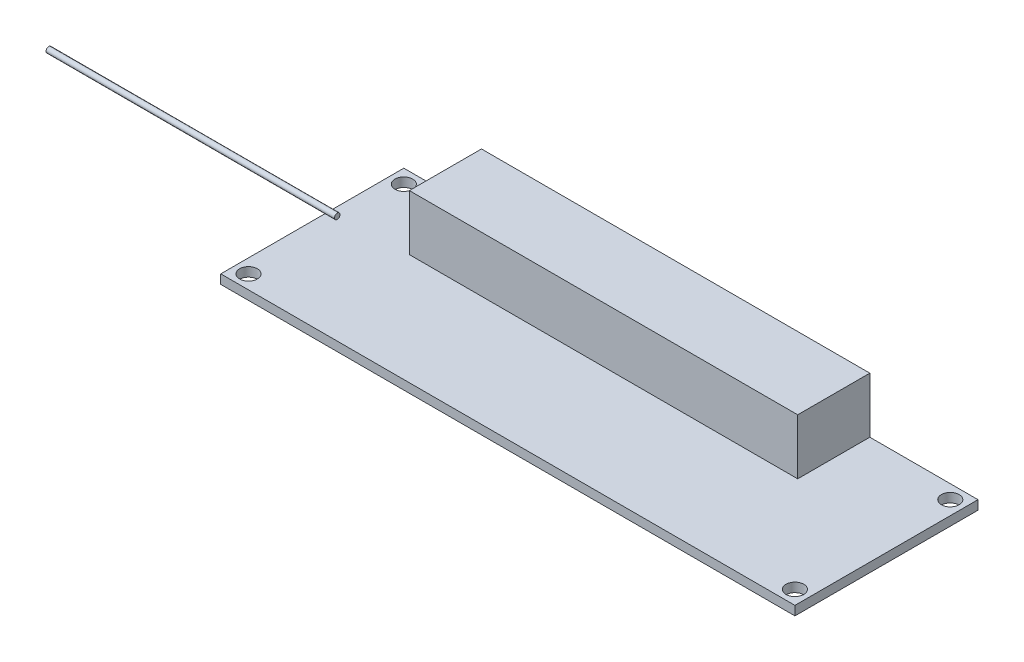
ISO-10303-21;
HEADER;
FILE_DESCRIPTION(('STEP AP214'),'2;1');
FILE_NAME('part.step','',(''),(''),'','','');
FILE_SCHEMA(('AUTOMOTIVE_DESIGN { 1 0 10303 214 1 1 1 1 }'));
ENDSEC;
DATA;
#1=APPLICATION_CONTEXT('core data for automotive mechanical design processes');
#2=APPLICATION_PROTOCOL_DEFINITION('international standard','automotive_design',2000,#1);
#3=PRODUCT_CONTEXT('',#1,'mechanical');
#4=PRODUCT('Part','Part','',(#3));
#5=PRODUCT_RELATED_PRODUCT_CATEGORY('part','',(#4));
#6=PRODUCT_DEFINITION_FORMATION('','',#4);
#7=PRODUCT_DEFINITION_CONTEXT('part definition',#1,'design');
#8=PRODUCT_DEFINITION('design','',#6,#7);
#9=PRODUCT_DEFINITION_SHAPE('','',#8);
#10=(LENGTH_UNIT() NAMED_UNIT(*) SI_UNIT(.MILLI.,.METRE.));
#11=(NAMED_UNIT(*) PLANE_ANGLE_UNIT() SI_UNIT($,.RADIAN.));
#12=(NAMED_UNIT(*) SI_UNIT($,.STERADIAN.) SOLID_ANGLE_UNIT());
#13=UNCERTAINTY_MEASURE_WITH_UNIT(LENGTH_MEASURE(1.E-05),#10,'distance_accuracy_value','');
#14=(GEOMETRIC_REPRESENTATION_CONTEXT(3) GLOBAL_UNCERTAINTY_ASSIGNED_CONTEXT((#13)) GLOBAL_UNIT_ASSIGNED_CONTEXT((#10,
#11,#12)) REPRESENTATION_CONTEXT('',''));
#15=CARTESIAN_POINT('',(0.,0.,0.));
#16=DIRECTION('',(0.,0.,1.));
#17=DIRECTION('',(1.,0.,0.));
#18=AXIS2_PLACEMENT_3D('',#15,#16,#17);
#19=CARTESIAN_POINT('',(-49.75,2.15,-2.5));
#20=DIRECTION('',(-1.,0.,0.));
#21=DIRECTION('',(0.,0.,1.));
#22=AXIS2_PLACEMENT_3D('',#19,#20,#21);
#23=CYLINDRICAL_SURFACE('',#22,0.5);
#24=CARTESIAN_POINT('',(-49.75,2.15,-2.5));
#25=DIRECTION('',(-1.,0.,0.));
#26=DIRECTION('',(0.,0.,1.));
#27=AXIS2_PLACEMENT_3D('',#24,#25,#26);
#28=CIRCLE('',#27,0.5);
#29=CARTESIAN_POINT('',(-49.75,2.15,-2.));
#30=VERTEX_POINT('',#29);
#31=EDGE_CURVE('E11',#30,#30,#28,.T.);
#32=ORIENTED_EDGE('',*,*,#31,.T.);
#33=EDGE_LOOP('',(#32));
#34=FACE_BOUND('',#33,.T.);
#35=CARTESIAN_POINT('',(-101.75,2.15,-2.49999999999999));
#36=DIRECTION('',(-1.,0.,0.));
#37=DIRECTION('',(0.,0.,1.));
#38=AXIS2_PLACEMENT_3D('',#35,#36,#37);
#39=CIRCLE('',#38,0.5);
#40=CARTESIAN_POINT('',(-101.75,2.15,-1.99999999999999));
#41=VERTEX_POINT('',#40);
#42=EDGE_CURVE('E50',#41,#41,#39,.T.);
#43=ORIENTED_EDGE('',*,*,#42,.F.);
#44=EDGE_LOOP('',(#43));
#45=FACE_BOUND('',#44,.T.);
#46=ADVANCED_FACE('F44',(#34,#45),#23,.T.);
#47=CARTESIAN_POINT('',(-49.75,2.15,-2.5));
#48=DIRECTION('',(-1.,0.,0.));
#49=DIRECTION('',(0.,0.,1.));
#50=AXIS2_PLACEMENT_3D('',#47,#48,#49);
#51=PLANE('',#50);
#52=ORIENTED_EDGE('',*,*,#31,.F.);
#53=EDGE_LOOP('',(#52));
#54=FACE_BOUND('',#53,.T.);
#55=ADVANCED_FACE('F59',(#54),#51,.F.);
#56=CARTESIAN_POINT('',(-101.75,2.15,-2.49999999999999));
#57=DIRECTION('',(-1.,0.,0.));
#58=DIRECTION('',(0.,0.,1.));
#59=AXIS2_PLACEMENT_3D('',#56,#57,#58);
#60=PLANE('',#59);
#61=ORIENTED_EDGE('',*,*,#42,.T.);
#62=EDGE_LOOP('',(#61));
#63=FACE_BOUND('',#62,.T.);
#64=ADVANCED_FACE('F56',(#63),#60,.T.);
#65=CLOSED_SHELL('',(#46,#55,#64));
#66=MANIFOLD_SOLID_BREP('B2',#65);
#67=CARTESIAN_POINT('',(-51.75,1.65,-16.5));
#68=DIRECTION('',(1.,0.,0.));
#69=DIRECTION('',(0.,0.,-1.));
#70=AXIS2_PLACEMENT_3D('',#67,#68,#69);
#71=PLANE('',#70);
#72=DIRECTION('',(0.,0.,1.));
#73=VECTOR('',#72,1.);
#74=CARTESIAN_POINT('',(-51.75,0.,-16.5));
#75=LINE('',#74,#73);
#76=CARTESIAN_POINT('',(-51.75,0.,-16.5));
#77=VERTEX_POINT('',#76);
#78=CARTESIAN_POINT('',(-51.75,0.,16.5));
#79=VERTEX_POINT('',#78);
#80=EDGE_CURVE('E168',#77,#79,#75,.T.);
#81=ORIENTED_EDGE('',*,*,#80,.T.);
#82=DIRECTION('',(0.,-1.,0.));
#83=VECTOR('',#82,1.);
#84=CARTESIAN_POINT('',(-51.75,1.65,16.5));
#85=LINE('',#84,#83);
#86=CARTESIAN_POINT('',(-51.75,1.65,16.5));
#87=VERTEX_POINT('',#86);
#88=EDGE_CURVE('E42',#87,#79,#85,.T.);
#89=ORIENTED_EDGE('',*,*,#88,.F.);
#90=DIRECTION('',(0.,0.,1.));
#91=VECTOR('',#90,1.);
#92=CARTESIAN_POINT('',(-51.75,1.65,-16.5));
#93=LINE('',#92,#91);
#94=CARTESIAN_POINT('',(-51.75,1.65,-16.5));
#95=VERTEX_POINT('',#94);
#96=EDGE_CURVE('E177',#95,#87,#93,.T.);
#97=ORIENTED_EDGE('',*,*,#96,.F.);
#98=DIRECTION('',(0.,-1.,0.));
#99=VECTOR('',#98,1.);
#100=CARTESIAN_POINT('',(-51.75,1.65,-16.5));
#101=LINE('',#100,#99);
#102=EDGE_CURVE('E187',#95,#77,#101,.T.);
#103=ORIENTED_EDGE('',*,*,#102,.T.);
#104=EDGE_LOOP('',(#81,#89,#97,#103));
#105=FACE_BOUND('',#104,.T.);
#106=ADVANCED_FACE('F84',(#105),#71,.F.);
#107=CARTESIAN_POINT('',(-51.75,1.65,16.5));
#108=DIRECTION('',(0.,0.,-1.));
#109=DIRECTION('',(-1.,0.,0.));
#110=AXIS2_PLACEMENT_3D('',#107,#108,#109);
#111=PLANE('',#110);
#112=DIRECTION('',(1.,0.,0.));
#113=VECTOR('',#112,1.);
#114=CARTESIAN_POINT('',(-51.75,0.,16.5));
#115=LINE('',#114,#113);
#116=CARTESIAN_POINT('',(51.75,0.,16.5));
#117=VERTEX_POINT('',#116);
#118=EDGE_CURVE('E171',#79,#117,#115,.T.);
#119=ORIENTED_EDGE('',*,*,#118,.T.);
#120=DIRECTION('',(0.,-1.,0.));
#121=VECTOR('',#120,1.);
#122=CARTESIAN_POINT('',(51.75,1.65,16.5));
#123=LINE('',#122,#121);
#124=CARTESIAN_POINT('',(51.75,1.65,16.5));
#125=VERTEX_POINT('',#124);
#126=EDGE_CURVE('E91',#125,#117,#123,.T.);
#127=ORIENTED_EDGE('',*,*,#126,.F.);
#128=DIRECTION('',(1.,0.,0.));
#129=VECTOR('',#128,1.);
#130=CARTESIAN_POINT('',(-51.75,1.65,16.5));
#131=LINE('',#130,#129);
#132=EDGE_CURVE('E180',#87,#125,#131,.T.);
#133=ORIENTED_EDGE('',*,*,#132,.F.);
#134=ORIENTED_EDGE('',*,*,#88,.T.);
#135=EDGE_LOOP('',(#119,#127,#133,#134));
#136=FACE_BOUND('',#135,.T.);
#137=ADVANCED_FACE('F279',(#136),#111,.F.);
#138=CARTESIAN_POINT('',(51.75,1.65,-16.5));
#139=DIRECTION('',(-1.,0.,0.));
#140=DIRECTION('',(0.,0.,1.));
#141=AXIS2_PLACEMENT_3D('',#138,#139,#140);
#142=PLANE('',#141);
#143=DIRECTION('',(0.,0.,-1.));
#144=VECTOR('',#143,1.);
#145=CARTESIAN_POINT('',(51.75,0.,-16.5));
#146=LINE('',#145,#144);
#147=CARTESIAN_POINT('',(51.75,0.,-16.5));
#148=VERTEX_POINT('',#147);
#149=EDGE_CURVE('E190',#117,#148,#146,.T.);
#150=ORIENTED_EDGE('',*,*,#149,.T.);
#151=DIRECTION('',(0.,-1.,0.));
#152=VECTOR('',#151,1.);
#153=CARTESIAN_POINT('',(51.75,1.65,-16.5));
#154=LINE('',#153,#152);
#155=CARTESIAN_POINT('',(51.75,1.65,-16.5));
#156=VERTEX_POINT('',#155);
#157=EDGE_CURVE('E195',#156,#148,#154,.T.);
#158=ORIENTED_EDGE('',*,*,#157,.F.);
#159=DIRECTION('',(0.,0.,-1.));
#160=VECTOR('',#159,1.);
#161=CARTESIAN_POINT('',(51.75,1.65,-16.5));
#162=LINE('',#161,#160);
#163=EDGE_CURVE('E183',#125,#156,#162,.T.);
#164=ORIENTED_EDGE('',*,*,#163,.F.);
#165=ORIENTED_EDGE('',*,*,#126,.T.);
#166=EDGE_LOOP('',(#150,#158,#164,#165));
#167=FACE_BOUND('',#166,.T.);
#168=ADVANCED_FACE('F202',(#167),#142,.F.);
#169=CARTESIAN_POINT('',(-51.75,1.65,-16.5));
#170=DIRECTION('',(0.,0.,1.));
#171=DIRECTION('',(1.,0.,0.));
#172=AXIS2_PLACEMENT_3D('',#169,#170,#171);
#173=PLANE('',#172);
#174=DIRECTION('',(-1.,0.,0.));
#175=VECTOR('',#174,1.);
#176=CARTESIAN_POINT('',(-51.75,0.,-16.5));
#177=LINE('',#176,#175);
#178=EDGE_CURVE('E181',#148,#77,#177,.T.);
#179=ORIENTED_EDGE('',*,*,#178,.T.);
#180=ORIENTED_EDGE('',*,*,#102,.F.);
#181=DIRECTION('',(-1.,0.,0.));
#182=VECTOR('',#181,1.);
#183=CARTESIAN_POINT('',(-51.75,1.65,-16.5));
#184=LINE('',#183,#182);
#185=CARTESIAN_POINT('',(-37.75,1.65,-16.5));
#186=VERTEX_POINT('',#185);
#187=EDGE_CURVE('E185',#186,#95,#184,.T.);
#188=ORIENTED_EDGE('',*,*,#187,.F.);
#189=DIRECTION('',(0.,-1.,0.));
#190=VECTOR('',#189,1.);
#191=CARTESIAN_POINT('',(-37.75,11.65,-16.5));
#192=LINE('',#191,#190);
#193=CARTESIAN_POINT('',(-37.75,11.65,-16.5));
#194=VERTEX_POINT('',#193);
#195=EDGE_CURVE('E217',#194,#186,#192,.T.);
#196=ORIENTED_EDGE('',*,*,#195,.F.);
#197=DIRECTION('',(-1.,0.,0.));
#198=VECTOR('',#197,1.);
#199=CARTESIAN_POINT('',(-37.75,11.65,-16.5));
#200=LINE('',#199,#198);
#201=CARTESIAN_POINT('',(32.25,11.65,-16.5));
#202=VERTEX_POINT('',#201);
#203=EDGE_CURVE('E161',#202,#194,#200,.T.);
#204=ORIENTED_EDGE('',*,*,#203,.F.);
#205=DIRECTION('',(0.,-1.,0.));
#206=VECTOR('',#205,1.);
#207=CARTESIAN_POINT('',(32.25,11.65,-16.5));
#208=LINE('',#207,#206);
#209=CARTESIAN_POINT('',(32.25,1.65,-16.5));
#210=VERTEX_POINT('',#209);
#211=EDGE_CURVE('E173',#202,#210,#208,.T.);
#212=ORIENTED_EDGE('',*,*,#211,.T.);
#213=EDGE_CURVE('E186',#156,#210,#184,.T.);
#214=ORIENTED_EDGE('',*,*,#213,.F.);
#215=ORIENTED_EDGE('',*,*,#157,.T.);
#216=EDGE_LOOP('',(#179,#180,#188,#196,#204,#212,#214,#215));
#217=FACE_BOUND('',#216,.T.);
#218=ADVANCED_FACE('F211',(#217),#173,.F.);
#219=CARTESIAN_POINT('',(0.,1.65,0.));
#220=DIRECTION('',(0.,1.,0.));
#221=DIRECTION('',(0.,0.,1.));
#222=AXIS2_PLACEMENT_3D('',#219,#220,#221);
#223=PLANE('',#222);
#224=CARTESIAN_POINT('',(-49.25,1.65,14.));
#225=DIRECTION('',(0.,1.,0.));
#226=DIRECTION('',(0.,0.,-1.));
#227=AXIS2_PLACEMENT_3D('',#224,#225,#226);
#228=CIRCLE('',#227,1.6);
#229=CARTESIAN_POINT('',(-49.25,1.65,12.4));
#230=VERTEX_POINT('',#229);
#231=EDGE_CURVE('E234',#230,#230,#228,.T.);
#232=ORIENTED_EDGE('',*,*,#231,.F.);
#233=EDGE_LOOP('',(#232));
#234=FACE_BOUND('',#233,.T.);
#235=CARTESIAN_POINT('',(49.25,1.65,14.));
#236=DIRECTION('',(0.,1.,0.));
#237=DIRECTION('',(0.,0.,1.));
#238=AXIS2_PLACEMENT_3D('',#235,#236,#237);
#239=CIRCLE('',#238,1.6);
#240=CARTESIAN_POINT('',(49.25,1.65,15.6));
#241=VERTEX_POINT('',#240);
#242=EDGE_CURVE('E240',#241,#241,#239,.T.);
#243=ORIENTED_EDGE('',*,*,#242,.F.);
#244=EDGE_LOOP('',(#243));
#245=FACE_BOUND('',#244,.T.);
#246=CARTESIAN_POINT('',(49.25,1.65,-14.));
#247=DIRECTION('',(0.,1.,0.));
#248=DIRECTION('',(0.,0.,-1.));
#249=AXIS2_PLACEMENT_3D('',#246,#247,#248);
#250=CIRCLE('',#249,1.6);
#251=CARTESIAN_POINT('',(49.25,1.65,-15.6));
#252=VERTEX_POINT('',#251);
#253=EDGE_CURVE('E246',#252,#252,#250,.T.);
#254=ORIENTED_EDGE('',*,*,#253,.F.);
#255=EDGE_LOOP('',(#254));
#256=FACE_BOUND('',#255,.T.);
#257=CARTESIAN_POINT('',(-49.25,1.65,-14.));
#258=DIRECTION('',(0.,1.,0.));
#259=DIRECTION('',(0.,0.,1.));
#260=AXIS2_PLACEMENT_3D('',#257,#258,#259);
#261=CIRCLE('',#260,1.6);
#262=CARTESIAN_POINT('',(-49.25,1.65,-12.4));
#263=VERTEX_POINT('',#262);
#264=EDGE_CURVE('E228',#263,#263,#261,.T.);
#265=ORIENTED_EDGE('',*,*,#264,.F.);
#266=EDGE_LOOP('',(#265));
#267=FACE_BOUND('',#266,.T.);
#268=DIRECTION('',(0.,0.,1.));
#269=VECTOR('',#268,1.);
#270=CARTESIAN_POINT('',(-37.75,1.65,-16.5));
#271=LINE('',#270,#269);
#272=CARTESIAN_POINT('',(-37.75,1.65,-3.5));
#273=VERTEX_POINT('',#272);
#274=EDGE_CURVE('E103',#186,#273,#271,.T.);
#275=ORIENTED_EDGE('',*,*,#274,.F.);
#276=ORIENTED_EDGE('',*,*,#187,.T.);
#277=ORIENTED_EDGE('',*,*,#96,.T.);
#278=ORIENTED_EDGE('',*,*,#132,.T.);
#279=ORIENTED_EDGE('',*,*,#163,.T.);
#280=ORIENTED_EDGE('',*,*,#213,.T.);
#281=DIRECTION('',(0.,0.,-1.));
#282=VECTOR('',#281,1.);
#283=CARTESIAN_POINT('',(32.25,1.65,-16.5));
#284=LINE('',#283,#282);
#285=CARTESIAN_POINT('',(32.25,1.65,-3.5));
#286=VERTEX_POINT('',#285);
#287=EDGE_CURVE('E165',#286,#210,#284,.T.);
#288=ORIENTED_EDGE('',*,*,#287,.F.);
#289=DIRECTION('',(1.,0.,0.));
#290=VECTOR('',#289,1.);
#291=CARTESIAN_POINT('',(-37.75,1.65,-3.5));
#292=LINE('',#291,#290);
#293=EDGE_CURVE('E98',#273,#286,#292,.T.);
#294=ORIENTED_EDGE('',*,*,#293,.F.);
#295=EDGE_LOOP('',(#275,#276,#277,#278,#279,#280,#288,#294));
#296=FACE_BOUND('',#295,.T.);
#297=ADVANCED_FACE('F216',(#234,#245,#256,#267,#296),#223,.T.);
#298=CARTESIAN_POINT('',(0.,0.,0.));
#299=DIRECTION('',(0.,1.,0.));
#300=DIRECTION('',(0.,0.,1.));
#301=AXIS2_PLACEMENT_3D('',#298,#299,#300);
#302=PLANE('',#301);
#303=CARTESIAN_POINT('',(-49.25,0.,14.));
#304=DIRECTION('',(0.,1.,0.));
#305=DIRECTION('',(0.,0.,-1.));
#306=AXIS2_PLACEMENT_3D('',#303,#304,#305);
#307=CIRCLE('',#306,1.6);
#308=CARTESIAN_POINT('',(-49.25,0.,12.4));
#309=VERTEX_POINT('',#308);
#310=EDGE_CURVE('E237',#309,#309,#307,.T.);
#311=ORIENTED_EDGE('',*,*,#310,.T.);
#312=EDGE_LOOP('',(#311));
#313=FACE_BOUND('',#312,.T.);
#314=CARTESIAN_POINT('',(49.25,0.,14.));
#315=DIRECTION('',(0.,1.,0.));
#316=DIRECTION('',(0.,0.,1.));
#317=AXIS2_PLACEMENT_3D('',#314,#315,#316);
#318=CIRCLE('',#317,1.6);
#319=CARTESIAN_POINT('',(49.25,0.,15.6));
#320=VERTEX_POINT('',#319);
#321=EDGE_CURVE('E243',#320,#320,#318,.T.);
#322=ORIENTED_EDGE('',*,*,#321,.T.);
#323=EDGE_LOOP('',(#322));
#324=FACE_BOUND('',#323,.T.);
#325=CARTESIAN_POINT('',(49.25,0.,-14.));
#326=DIRECTION('',(0.,1.,0.));
#327=DIRECTION('',(0.,0.,-1.));
#328=AXIS2_PLACEMENT_3D('',#325,#326,#327);
#329=CIRCLE('',#328,1.6);
#330=CARTESIAN_POINT('',(49.25,0.,-15.6));
#331=VERTEX_POINT('',#330);
#332=EDGE_CURVE('E231',#331,#331,#329,.T.);
#333=ORIENTED_EDGE('',*,*,#332,.T.);
#334=EDGE_LOOP('',(#333));
#335=FACE_BOUND('',#334,.T.);
#336=CARTESIAN_POINT('',(-49.25,0.,-14.));
#337=DIRECTION('',(0.,1.,0.));
#338=DIRECTION('',(0.,0.,1.));
#339=AXIS2_PLACEMENT_3D('',#336,#337,#338);
#340=CIRCLE('',#339,1.6);
#341=CARTESIAN_POINT('',(-49.25,0.,-12.4));
#342=VERTEX_POINT('',#341);
#343=EDGE_CURVE('E225',#342,#342,#340,.T.);
#344=ORIENTED_EDGE('',*,*,#343,.T.);
#345=EDGE_LOOP('',(#344));
#346=FACE_BOUND('',#345,.T.);
#347=ORIENTED_EDGE('',*,*,#80,.F.);
#348=ORIENTED_EDGE('',*,*,#178,.F.);
#349=ORIENTED_EDGE('',*,*,#149,.F.);
#350=ORIENTED_EDGE('',*,*,#118,.F.);
#351=EDGE_LOOP('',(#347,#348,#349,#350));
#352=FACE_BOUND('',#351,.T.);
#353=ADVANCED_FACE('F208',(#313,#324,#335,#346,#352),#302,.F.);
#354=CARTESIAN_POINT('',(-37.75,11.65,-16.5));
#355=DIRECTION('',(1.,0.,0.));
#356=DIRECTION('',(0.,0.,-1.));
#357=AXIS2_PLACEMENT_3D('',#354,#355,#356);
#358=PLANE('',#357);
#359=ORIENTED_EDGE('',*,*,#274,.T.);
#360=DIRECTION('',(0.,-1.,0.));
#361=VECTOR('',#360,1.);
#362=CARTESIAN_POINT('',(-37.75,11.65,-3.5));
#363=LINE('',#362,#361);
#364=CARTESIAN_POINT('',(-37.75,11.65,-3.5));
#365=VERTEX_POINT('',#364);
#366=EDGE_CURVE('E150',#365,#273,#363,.T.);
#367=ORIENTED_EDGE('',*,*,#366,.F.);
#368=DIRECTION('',(0.,0.,1.));
#369=VECTOR('',#368,1.);
#370=CARTESIAN_POINT('',(-37.75,11.65,-16.5));
#371=LINE('',#370,#369);
#372=EDGE_CURVE('E156',#194,#365,#371,.T.);
#373=ORIENTED_EDGE('',*,*,#372,.F.);
#374=ORIENTED_EDGE('',*,*,#195,.T.);
#375=EDGE_LOOP('',(#359,#367,#373,#374));
#376=FACE_BOUND('',#375,.T.);
#377=ADVANCED_FACE('F167',(#376),#358,.F.);
#378=CARTESIAN_POINT('',(-37.75,11.65,-3.5));
#379=DIRECTION('',(0.,0.,-1.));
#380=DIRECTION('',(-1.,0.,0.));
#381=AXIS2_PLACEMENT_3D('',#378,#379,#380);
#382=PLANE('',#381);
#383=ORIENTED_EDGE('',*,*,#293,.T.);
#384=DIRECTION('',(0.,-1.,0.));
#385=VECTOR('',#384,1.);
#386=CARTESIAN_POINT('',(32.25,11.65,-3.5));
#387=LINE('',#386,#385);
#388=CARTESIAN_POINT('',(32.25,11.65,-3.5));
#389=VERTEX_POINT('',#388);
#390=EDGE_CURVE('E152',#389,#286,#387,.T.);
#391=ORIENTED_EDGE('',*,*,#390,.F.);
#392=DIRECTION('',(1.,0.,0.));
#393=VECTOR('',#392,1.);
#394=CARTESIAN_POINT('',(-37.75,11.65,-3.5));
#395=LINE('',#394,#393);
#396=EDGE_CURVE('E146',#365,#389,#395,.T.);
#397=ORIENTED_EDGE('',*,*,#396,.F.);
#398=ORIENTED_EDGE('',*,*,#366,.T.);
#399=EDGE_LOOP('',(#383,#391,#397,#398));
#400=FACE_BOUND('',#399,.T.);
#401=ADVANCED_FACE('F148',(#400),#382,.F.);
#402=CARTESIAN_POINT('',(32.25,11.65,-16.5));
#403=DIRECTION('',(-1.,0.,0.));
#404=DIRECTION('',(0.,0.,1.));
#405=AXIS2_PLACEMENT_3D('',#402,#403,#404);
#406=PLANE('',#405);
#407=ORIENTED_EDGE('',*,*,#287,.T.);
#408=ORIENTED_EDGE('',*,*,#211,.F.);
#409=DIRECTION('',(0.,0.,-1.));
#410=VECTOR('',#409,1.);
#411=CARTESIAN_POINT('',(32.25,11.65,-16.5));
#412=LINE('',#411,#410);
#413=EDGE_CURVE('E155',#389,#202,#412,.T.);
#414=ORIENTED_EDGE('',*,*,#413,.F.);
#415=ORIENTED_EDGE('',*,*,#390,.T.);
#416=EDGE_LOOP('',(#407,#408,#414,#415));
#417=FACE_BOUND('',#416,.T.);
#418=ADVANCED_FACE('F274',(#417),#406,.F.);
#419=CARTESIAN_POINT('',(0.,11.65,0.));
#420=DIRECTION('',(0.,1.,0.));
#421=DIRECTION('',(0.,0.,1.));
#422=AXIS2_PLACEMENT_3D('',#419,#420,#421);
#423=PLANE('',#422);
#424=ORIENTED_EDGE('',*,*,#372,.T.);
#425=ORIENTED_EDGE('',*,*,#396,.T.);
#426=ORIENTED_EDGE('',*,*,#413,.T.);
#427=ORIENTED_EDGE('',*,*,#203,.T.);
#428=EDGE_LOOP('',(#424,#425,#426,#427));
#429=FACE_BOUND('',#428,.T.);
#430=ADVANCED_FACE('F159',(#429),#423,.T.);
#431=CARTESIAN_POINT('',(-49.25,0.,-14.));
#432=DIRECTION('',(0.,1.,0.));
#433=DIRECTION('',(0.,0.,1.));
#434=AXIS2_PLACEMENT_3D('',#431,#432,#433);
#435=CYLINDRICAL_SURFACE('',#434,1.6);
#436=ORIENTED_EDGE('',*,*,#343,.F.);
#437=EDGE_LOOP('',(#436));
#438=FACE_BOUND('',#437,.T.);
#439=ORIENTED_EDGE('',*,*,#264,.T.);
#440=EDGE_LOOP('',(#439));
#441=FACE_BOUND('',#440,.T.);
#442=ADVANCED_FACE('F258',(#438,#441),#435,.F.);
#443=CARTESIAN_POINT('',(49.25,0.,-14.));
#444=DIRECTION('',(0.,1.,0.));
#445=DIRECTION('',(0.,0.,1.));
#446=AXIS2_PLACEMENT_3D('',#443,#444,#445);
#447=CYLINDRICAL_SURFACE('',#446,1.6);
#448=ORIENTED_EDGE('',*,*,#332,.F.);
#449=EDGE_LOOP('',(#448));
#450=FACE_BOUND('',#449,.T.);
#451=ORIENTED_EDGE('',*,*,#253,.T.);
#452=EDGE_LOOP('',(#451));
#453=FACE_BOUND('',#452,.T.);
#454=ADVANCED_FACE('F254',(#450,#453),#447,.F.);
#455=CARTESIAN_POINT('',(49.25,0.,14.));
#456=DIRECTION('',(0.,1.,0.));
#457=DIRECTION('',(0.,0.,1.));
#458=AXIS2_PLACEMENT_3D('',#455,#456,#457);
#459=CYLINDRICAL_SURFACE('',#458,1.6);
#460=ORIENTED_EDGE('',*,*,#321,.F.);
#461=EDGE_LOOP('',(#460));
#462=FACE_BOUND('',#461,.T.);
#463=ORIENTED_EDGE('',*,*,#242,.T.);
#464=EDGE_LOOP('',(#463));
#465=FACE_BOUND('',#464,.T.);
#466=ADVANCED_FACE('F257',(#462,#465),#459,.F.);
#467=CARTESIAN_POINT('',(-49.25,0.,14.));
#468=DIRECTION('',(0.,1.,0.));
#469=DIRECTION('',(0.,0.,1.));
#470=AXIS2_PLACEMENT_3D('',#467,#468,#469);
#471=CYLINDRICAL_SURFACE('',#470,1.6);
#472=ORIENTED_EDGE('',*,*,#310,.F.);
#473=EDGE_LOOP('',(#472));
#474=FACE_BOUND('',#473,.T.);
#475=ORIENTED_EDGE('',*,*,#231,.T.);
#476=EDGE_LOOP('',(#475));
#477=FACE_BOUND('',#476,.T.);
#478=ADVANCED_FACE('F341',(#474,#477),#471,.F.);
#479=CLOSED_SHELL('',(#106,#137,#168,#218,#297,#353,#377,#401,#418,#430,#442,#454,#466,#478));
#480=MANIFOLD_SOLID_BREP('B6',#479);
#481=ADVANCED_BREP_SHAPE_REPRESENTATION('',(#18,#66,#480),#14);
#482=SHAPE_DEFINITION_REPRESENTATION(#9,#481);
ENDSEC;
END-ISO-10303-21;
